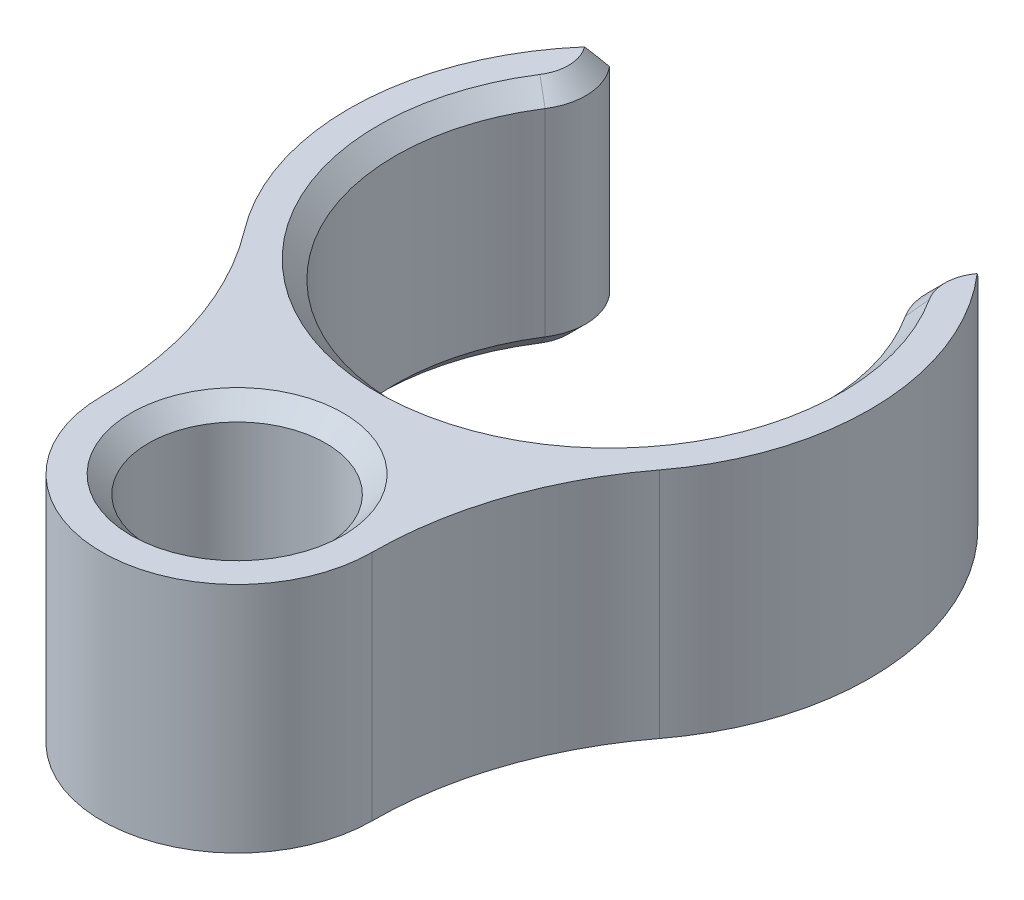
ISO-10303-21;
HEADER;
FILE_DESCRIPTION(('STEP AP214'),'2;1');
FILE_NAME('part.step','',(''),(''),'','','');
FILE_SCHEMA(('AUTOMOTIVE_DESIGN { 1 0 10303 214 1 1 1 1 }'));
ENDSEC;
DATA;
#1=APPLICATION_CONTEXT('core data for automotive mechanical design processes');
#2=APPLICATION_PROTOCOL_DEFINITION('international standard','automotive_design',2000,#1);
#3=PRODUCT_CONTEXT('',#1,'mechanical');
#4=PRODUCT('Part','Part','',(#3));
#5=PRODUCT_RELATED_PRODUCT_CATEGORY('part','',(#4));
#6=PRODUCT_DEFINITION_FORMATION('','',#4);
#7=PRODUCT_DEFINITION_CONTEXT('part definition',#1,'design');
#8=PRODUCT_DEFINITION('design','',#6,#7);
#9=PRODUCT_DEFINITION_SHAPE('','',#8);
#10=(LENGTH_UNIT() NAMED_UNIT(*) SI_UNIT(.MILLI.,.METRE.));
#11=(NAMED_UNIT(*) PLANE_ANGLE_UNIT() SI_UNIT($,.RADIAN.));
#12=(NAMED_UNIT(*) SI_UNIT($,.STERADIAN.) SOLID_ANGLE_UNIT());
#13=UNCERTAINTY_MEASURE_WITH_UNIT(LENGTH_MEASURE(1.E-05),#10,'distance_accuracy_value','');
#14=(GEOMETRIC_REPRESENTATION_CONTEXT(3) GLOBAL_UNCERTAINTY_ASSIGNED_CONTEXT((#13)) GLOBAL_UNIT_ASSIGNED_CONTEXT((#10,
#11,#12)) REPRESENTATION_CONTEXT('',''));
#15=CARTESIAN_POINT('',(0.,0.,0.));
#16=DIRECTION('',(0.,0.,1.));
#17=DIRECTION('',(1.,0.,0.));
#18=AXIS2_PLACEMENT_3D('',#15,#16,#17);
#19=CARTESIAN_POINT('',(0.,10.,-16.01));
#20=DIRECTION('',(0.,-1.,0.));
#21=DIRECTION('',(0.,0.,-1.));
#22=AXIS2_PLACEMENT_3D('',#19,#20,#21);
#23=CYLINDRICAL_SURFACE('',#22,11.2);
#24=DIRECTION('',(0.,-1.,0.));
#25=VECTOR('',#24,1.);
#26=CARTESIAN_POINT('',(-7.91959594928932,10.,-23.9295959492893));
#27=LINE('',#26,#25);
#28=CARTESIAN_POINT('',(-7.91959594928932,9.25,-23.9295959492893));
#29=VERTEX_POINT('',#28);
#30=CARTESIAN_POINT('',(-7.91959594928932,0.750000000000004,-23.9295959492893));
#31=VERTEX_POINT('',#30);
#32=EDGE_CURVE('E152',#29,#31,#27,.T.);
#33=ORIENTED_EDGE('',*,*,#32,.T.);
#34=CARTESIAN_POINT('',(-7.91959594928932,0.750000000000004,-23.9295959492893));
#35=CARTESIAN_POINT('',(-7.96415289216717,0.687261906162948,-23.8850385754403));
#36=CARTESIAN_POINT('',(-8.00835691250786,0.624555856665795,-23.8400829572508));
#37=CARTESIAN_POINT('',(-8.09606082038429,0.499253516320336,-23.7493656359172));
#38=CARTESIAN_POINT('',(-8.13956081283976,0.43665721038037,-23.7036040550467));
#39=CARTESIAN_POINT('',(-8.22587186522324,0.311601002962958,-23.6112517226287));
#40=CARTESIAN_POINT('',(-8.26868292374682,0.249141101763802,-23.5646609693913));
#41=CARTESIAN_POINT('',(-8.35364405397742,0.124410619117576,-23.4706061231883));
#42=CARTESIAN_POINT('',(-8.39579402522303,0.0621400675819424,-23.4231418998235));
#43=CARTESIAN_POINT('',(-8.43762103205099,0.,-23.3752258159197));
#44=B_SPLINE_CURVE_WITH_KNOTS('',3,(#34,#35,#36,#37,#38,#39,#40,#41,#42,#43),.UNSPECIFIED.,.F.,
.F.,(4,2,2,2,4),(0.,0.266758249137236,0.533476370854935,0.800195036220647,1.06695384797462),.UNSPECIFIED.);
#45=CARTESIAN_POINT('',(-8.43762103205099,0.,-23.3752258159197));
#46=VERTEX_POINT('',#45);
#47=EDGE_CURVE('E219',#31,#46,#44,.T.);
#48=ORIENTED_EDGE('',*,*,#47,.T.);
#49=CARTESIAN_POINT('',(0.,0.,-16.01));
#50=DIRECTION('',(0.,1.,0.));
#51=DIRECTION('',(0.,0.,1.));
#52=AXIS2_PLACEMENT_3D('',#49,#50,#51);
#53=CIRCLE('',#52,11.2);
#54=CARTESIAN_POINT('',(-8.91958501914342,0.,-9.2364482665095));
#55=VERTEX_POINT('',#54);
#56=EDGE_CURVE('E148',#46,#55,#53,.T.);
#57=ORIENTED_EDGE('',*,*,#56,.T.);
#58=DIRECTION('',(0.,-1.,0.));
#59=VECTOR('',#58,1.);
#60=CARTESIAN_POINT('',(-8.91958501914342,10.,-9.2364482665095));
#61=LINE('',#60,#59);
#62=CARTESIAN_POINT('',(-8.91958501914342,10.,-9.2364482665095));
#63=VERTEX_POINT('',#62);
#64=EDGE_CURVE('E145',#63,#55,#61,.T.);
#65=ORIENTED_EDGE('',*,*,#64,.F.);
#66=CARTESIAN_POINT('',(0.,10.,-16.01));
#67=DIRECTION('',(0.,1.,0.));
#68=DIRECTION('',(0.,0.,1.));
#69=AXIS2_PLACEMENT_3D('',#66,#67,#68);
#70=CIRCLE('',#69,11.2);
#71=CARTESIAN_POINT('',(-8.43762103205099,10.,-23.3752258159197));
#72=VERTEX_POINT('',#71);
#73=EDGE_CURVE('E134',#72,#63,#70,.T.);
#74=ORIENTED_EDGE('',*,*,#73,.F.);
#75=CARTESIAN_POINT('',(-8.43762103205099,10.,-23.3752258159197));
#76=CARTESIAN_POINT('',(-8.39579402522303,9.93785993241806,-23.4231418998235));
#77=CARTESIAN_POINT('',(-8.35364405397742,9.87558938088242,-23.4706061231883));
#78=CARTESIAN_POINT('',(-8.26868292374682,9.7508588982362,-23.5646609693913));
#79=CARTESIAN_POINT('',(-8.22587186522324,9.68839899703704,-23.6112517226287));
#80=CARTESIAN_POINT('',(-8.13956081283976,9.56334278961963,-23.7036040550467));
#81=CARTESIAN_POINT('',(-8.09606082038429,9.50074648367966,-23.7493656359172));
#82=CARTESIAN_POINT('',(-8.00835691250786,9.37544414333421,-23.8400829572508));
#83=CARTESIAN_POINT('',(-7.96415289216717,9.31273809383705,-23.8850385754403));
#84=CARTESIAN_POINT('',(-7.91959594928932,9.25,-23.9295959492893));
#85=B_SPLINE_CURVE_WITH_KNOTS('',3,(#75,#76,#77,#78,#79,#80,#81,#82,#83,#84),.UNSPECIFIED.,.F.,
.F.,(4,2,2,2,4),(0.,0.266758811753973,0.533477477119688,0.800195598837387,1.06695384797462),.UNSPECIFIED.);
#86=EDGE_CURVE('E211',#72,#29,#85,.T.);
#87=ORIENTED_EDGE('',*,*,#86,.T.);
#88=EDGE_LOOP('',(#33,#48,#57,#65,#74,#87));
#89=FACE_BOUND('',#88,.T.);
#90=ADVANCED_FACE('F43',(#89),#23,.T.);
#91=CARTESIAN_POINT('',(-21.0823747680891,10.,0.));
#92=DIRECTION('',(0.,-1.,0.));
#93=DIRECTION('',(0.,0.,-1.));
#94=AXIS2_PLACEMENT_3D('',#91,#92,#93);
#95=CYLINDRICAL_SURFACE('',#94,15.2723747680891);
#96=CARTESIAN_POINT('',(-21.0823747680891,0.,0.));
#97=DIRECTION('',(0.,1.,0.));
#98=DIRECTION('',(0.,0.,1.));
#99=AXIS2_PLACEMENT_3D('',#96,#97,#98);
#100=CIRCLE('',#99,15.2723747680891);
#101=CARTESIAN_POINT('',(-5.81,0.,0.));
#102=VERTEX_POINT('',#101);
#103=EDGE_CURVE('E164',#102,#55,#100,.T.);
#104=ORIENTED_EDGE('',*,*,#103,.F.);
#105=DIRECTION('',(0.,-1.,0.));
#106=VECTOR('',#105,1.);
#107=CARTESIAN_POINT('',(-5.81,10.,0.));
#108=LINE('',#107,#106);
#109=CARTESIAN_POINT('',(-5.81,10.,0.));
#110=VERTEX_POINT('',#109);
#111=EDGE_CURVE('E153',#110,#102,#108,.T.);
#112=ORIENTED_EDGE('',*,*,#111,.F.);
#113=CARTESIAN_POINT('',(-21.0823747680891,10.,0.));
#114=DIRECTION('',(0.,1.,0.));
#115=DIRECTION('',(0.,0.,1.));
#116=AXIS2_PLACEMENT_3D('',#113,#114,#115);
#117=CIRCLE('',#116,15.2723747680891);
#118=EDGE_CURVE('E138',#110,#63,#117,.T.);
#119=ORIENTED_EDGE('',*,*,#118,.T.);
#120=ORIENTED_EDGE('',*,*,#64,.T.);
#121=EDGE_LOOP('',(#104,#112,#119,#120));
#122=FACE_BOUND('',#121,.T.);
#123=ADVANCED_FACE('F155',(#122),#95,.F.);
#124=CARTESIAN_POINT('',(0.,10.,0.));
#125=DIRECTION('',(0.,-1.,0.));
#126=DIRECTION('',(0.,0.,-1.));
#127=AXIS2_PLACEMENT_3D('',#124,#125,#126);
#128=CYLINDRICAL_SURFACE('',#127,5.81);
#129=CARTESIAN_POINT('',(0.,0.,0.));
#130=DIRECTION('',(0.,1.,0.));
#131=DIRECTION('',(0.,0.,1.));
#132=AXIS2_PLACEMENT_3D('',#129,#130,#131);
#133=CIRCLE('',#132,5.81);
#134=CARTESIAN_POINT('',(5.81,0.,0.));
#135=VERTEX_POINT('',#134);
#136=EDGE_CURVE('E167',#102,#135,#133,.T.);
#137=ORIENTED_EDGE('',*,*,#136,.T.);
#138=DIRECTION('',(0.,-1.,0.));
#139=VECTOR('',#138,1.);
#140=CARTESIAN_POINT('',(5.81,10.,0.));
#141=LINE('',#140,#139);
#142=CARTESIAN_POINT('',(5.81,10.,0.));
#143=VERTEX_POINT('',#142);
#144=EDGE_CURVE('E177',#143,#135,#141,.T.);
#145=ORIENTED_EDGE('',*,*,#144,.F.);
#146=CARTESIAN_POINT('',(0.,10.,0.));
#147=DIRECTION('',(0.,1.,0.));
#148=DIRECTION('',(0.,0.,1.));
#149=AXIS2_PLACEMENT_3D('',#146,#147,#148);
#150=CIRCLE('',#149,5.81);
#151=EDGE_CURVE('E157',#110,#143,#150,.T.);
#152=ORIENTED_EDGE('',*,*,#151,.F.);
#153=ORIENTED_EDGE('',*,*,#111,.T.);
#154=EDGE_LOOP('',(#137,#145,#152,#153));
#155=FACE_BOUND('',#154,.T.);
#156=ADVANCED_FACE('F303',(#155),#128,.T.);
#157=CARTESIAN_POINT('',(21.0823747680891,10.,0.));
#158=DIRECTION('',(0.,-1.,0.));
#159=DIRECTION('',(0.,0.,-1.));
#160=AXIS2_PLACEMENT_3D('',#157,#158,#159);
#161=CYLINDRICAL_SURFACE('',#160,15.2723747680891);
#162=CARTESIAN_POINT('',(21.0823747680891,0.,0.));
#163=DIRECTION('',(0.,1.,0.));
#164=DIRECTION('',(0.,0.,1.));
#165=AXIS2_PLACEMENT_3D('',#162,#163,#164);
#166=CIRCLE('',#165,15.2723747680891);
#167=CARTESIAN_POINT('',(8.91958501914342,0.,-9.2364482665095));
#168=VERTEX_POINT('',#167);
#169=EDGE_CURVE('E169',#135,#168,#166,.F.);
#170=ORIENTED_EDGE('',*,*,#169,.T.);
#171=DIRECTION('',(0.,-1.,0.));
#172=VECTOR('',#171,1.);
#173=CARTESIAN_POINT('',(8.91958501914342,10.,-9.2364482665095));
#174=LINE('',#173,#172);
#175=CARTESIAN_POINT('',(8.91958501914342,10.,-9.2364482665095));
#176=VERTEX_POINT('',#175);
#177=EDGE_CURVE('E174',#176,#168,#174,.T.);
#178=ORIENTED_EDGE('',*,*,#177,.F.);
#179=CARTESIAN_POINT('',(21.0823747680891,10.,0.));
#180=DIRECTION('',(0.,1.,0.));
#181=DIRECTION('',(0.,0.,1.));
#182=AXIS2_PLACEMENT_3D('',#179,#180,#181);
#183=CIRCLE('',#182,15.2723747680891);
#184=EDGE_CURVE('E159',#143,#176,#183,.F.);
#185=ORIENTED_EDGE('',*,*,#184,.F.);
#186=ORIENTED_EDGE('',*,*,#144,.T.);
#187=EDGE_LOOP('',(#170,#178,#185,#186));
#188=FACE_BOUND('',#187,.T.);
#189=ADVANCED_FACE('F236',(#188),#161,.F.);
#190=CARTESIAN_POINT('',(8.43762103205099,0.,-23.3752258159198));
#191=VERTEX_POINT('',#190);
#192=EDGE_CURVE('E141',#168,#191,#53,.T.);
#193=ORIENTED_EDGE('',*,*,#192,.T.);
#194=CARTESIAN_POINT('',(8.43762103205099,0.,-23.3752258159198));
#195=CARTESIAN_POINT('',(8.39579402522303,0.0621400675819427,-23.4231418998235));
#196=CARTESIAN_POINT('',(8.35364405397741,0.124410619117577,-23.4706061231883));
#197=CARTESIAN_POINT('',(8.26868292374682,0.249141101763803,-23.5646609693913));
#198=CARTESIAN_POINT('',(8.22587186522324,0.311601002962958,-23.6112517226287));
#199=CARTESIAN_POINT('',(8.13956081283976,0.436657210380371,-23.7036040550467));
#200=CARTESIAN_POINT('',(8.09606082038428,0.499253516320336,-23.7493656359172));
#201=CARTESIAN_POINT('',(8.00835691250786,0.624555856665796,-23.8400829572508));
#202=CARTESIAN_POINT('',(7.96415289216717,0.687261906162949,-23.8850385754404));
#203=CARTESIAN_POINT('',(7.91959594928931,0.750000000000004,-23.9295959492894));
#204=B_SPLINE_CURVE_WITH_KNOTS('',3,(#194,#195,#196,#197,#198,#199,#200,#201,#202,#203),
.UNSPECIFIED.,.F.,.F.,(4,2,2,2,4),(0.,0.266758811753976,0.533477477119688,0.800195598837385,
1.06695384797462),.UNSPECIFIED.);
#205=CARTESIAN_POINT('',(7.91959594928932,0.750000000000004,-23.9295959492893));
#206=VERTEX_POINT('',#205);
#207=EDGE_CURVE('E249',#191,#206,#204,.T.);
#208=ORIENTED_EDGE('',*,*,#207,.T.);
#209=DIRECTION('',(0.,-1.,0.));
#210=VECTOR('',#209,1.);
#211=CARTESIAN_POINT('',(7.91959594928932,10.,-23.9295959492893));
#212=LINE('',#211,#210);
#213=CARTESIAN_POINT('',(7.91959594928932,9.25,-23.9295959492893));
#214=VERTEX_POINT('',#213);
#215=EDGE_CURVE('E171',#214,#206,#212,.T.);
#216=ORIENTED_EDGE('',*,*,#215,.F.);
#217=CARTESIAN_POINT('',(7.91959594928931,9.25,-23.9295959492894));
#218=CARTESIAN_POINT('',(7.96415289216717,9.31273809383705,-23.8850385754404));
#219=CARTESIAN_POINT('',(8.00835691250786,9.37544414333421,-23.8400829572508));
#220=CARTESIAN_POINT('',(8.09606082038428,9.50074648367967,-23.7493656359172));
#221=CARTESIAN_POINT('',(8.13956081283976,9.56334278961963,-23.7036040550467));
#222=CARTESIAN_POINT('',(8.22587186522324,9.68839899703704,-23.6112517226287));
#223=CARTESIAN_POINT('',(8.26868292374682,9.7508588982362,-23.5646609693913));
#224=CARTESIAN_POINT('',(8.35364405397742,9.87558938088242,-23.4706061231883));
#225=CARTESIAN_POINT('',(8.39579402522303,9.93785993241806,-23.4231418998235));
#226=CARTESIAN_POINT('',(8.43762103205099,10.,-23.3752258159197));
#227=B_SPLINE_CURVE_WITH_KNOTS('',3,(#217,#218,#219,#220,#221,#222,#223,#224,#225,#226),
.UNSPECIFIED.,.F.,.F.,(4,2,2,2,4),(0.,0.266758249137239,0.533476370854937,0.80019503622065,
1.06695384797462),.UNSPECIFIED.);
#228=CARTESIAN_POINT('',(8.43762103205099,10.,-23.3752258159197));
#229=VERTEX_POINT('',#228);
#230=EDGE_CURVE('E244',#214,#229,#227,.T.);
#231=ORIENTED_EDGE('',*,*,#230,.T.);
#232=EDGE_CURVE('E143',#176,#229,#70,.T.);
#233=ORIENTED_EDGE('',*,*,#232,.F.);
#234=ORIENTED_EDGE('',*,*,#177,.T.);
#235=EDGE_LOOP('',(#193,#208,#216,#231,#233,#234));
#236=FACE_BOUND('',#235,.T.);
#237=ADVANCED_FACE('F230',(#236),#23,.T.);
#238=CARTESIAN_POINT('',(0.,10.,-16.01));
#239=DIRECTION('',(0.,-1.,0.));
#240=DIRECTION('',(0.,0.,-1.));
#241=AXIS2_PLACEMENT_3D('',#238,#239,#240);
#242=CYLINDRICAL_SURFACE('',#241,9.2);
#243=DIRECTION('',(0.,-1.,0.));
#244=VECTOR('',#243,1.);
#245=CARTESIAN_POINT('',(7.74048286738709,10.,-20.982416412539));
#246=LINE('',#245,#244);
#247=CARTESIAN_POINT('',(7.74048286738709,9.25,-20.982416412539));
#248=VERTEX_POINT('',#247);
#249=CARTESIAN_POINT('',(7.74048286738709,0.750000000000004,-20.982416412539));
#250=VERTEX_POINT('',#249);
#251=EDGE_CURVE('E197',#248,#250,#246,.T.);
#252=ORIENTED_EDGE('',*,*,#251,.T.);
#253=CARTESIAN_POINT('',(0.,0.750000000000004,-16.01));
#254=DIRECTION('',(0.,1.,0.));
#255=DIRECTION('',(0.,0.,1.));
#256=AXIS2_PLACEMENT_3D('',#253,#254,#255);
#257=CIRCLE('',#256,9.2);
#258=CARTESIAN_POINT('',(-7.74048286738709,0.750000000000004,-20.982416412539));
#259=VERTEX_POINT('',#258);
#260=EDGE_CURVE('E535',#250,#259,#257,.F.);
#261=ORIENTED_EDGE('',*,*,#260,.T.);
#262=DIRECTION('',(0.,-1.,0.));
#263=VECTOR('',#262,1.);
#264=CARTESIAN_POINT('',(-7.74048286738709,10.,-20.982416412539));
#265=LINE('',#264,#263);
#266=CARTESIAN_POINT('',(-7.74048286738709,9.25,-20.982416412539));
#267=VERTEX_POINT('',#266);
#268=EDGE_CURVE('E194',#259,#267,#265,.F.);
#269=ORIENTED_EDGE('',*,*,#268,.T.);
#270=CARTESIAN_POINT('',(0.,9.25,-16.01));
#271=DIRECTION('',(0.,1.,0.));
#272=DIRECTION('',(0.,0.,1.));
#273=AXIS2_PLACEMENT_3D('',#270,#271,#272);
#274=CIRCLE('',#273,9.2);
#275=EDGE_CURVE('E537',#267,#248,#274,.T.);
#276=ORIENTED_EDGE('',*,*,#275,.T.);
#277=EDGE_LOOP('',(#252,#261,#269,#276));
#278=FACE_BOUND('',#277,.T.);
#279=ADVANCED_FACE('F235',(#278),#242,.F.);
#280=CARTESIAN_POINT('',(0.,10.,0.));
#281=DIRECTION('',(0.,-1.,0.));
#282=DIRECTION('',(0.,0.,-1.));
#283=AXIS2_PLACEMENT_3D('',#280,#281,#282);
#284=CYLINDRICAL_SURFACE('',#283,3.81);
#285=CARTESIAN_POINT('',(0.,0.749999999999999,0.));
#286=DIRECTION('',(0.,1.,0.));
#287=DIRECTION('',(0.,0.,1.));
#288=AXIS2_PLACEMENT_3D('',#285,#286,#287);
#289=CIRCLE('',#288,3.81);
#290=CARTESIAN_POINT('',(0.,0.749999999999999,3.81));
#291=VERTEX_POINT('',#290);
#292=EDGE_CURVE('E188',#291,#291,#289,.F.);
#293=ORIENTED_EDGE('',*,*,#292,.T.);
#294=EDGE_LOOP('',(#293));
#295=FACE_BOUND('',#294,.T.);
#296=CARTESIAN_POINT('',(0.,9.24999999999999,0.));
#297=DIRECTION('',(0.,1.,0.));
#298=DIRECTION('',(0.,0.,1.));
#299=AXIS2_PLACEMENT_3D('',#296,#297,#298);
#300=CIRCLE('',#299,3.81);
#301=CARTESIAN_POINT('',(0.,9.24999999999999,3.81));
#302=VERTEX_POINT('',#301);
#303=EDGE_CURVE('E185',#302,#302,#300,.T.);
#304=ORIENTED_EDGE('',*,*,#303,.T.);
#305=EDGE_LOOP('',(#304));
#306=FACE_BOUND('',#305,.T.);
#307=ADVANCED_FACE('F343',(#295,#306),#284,.F.);
#308=CARTESIAN_POINT('',(0.,10.,0.));
#309=DIRECTION('',(0.,1.,0.));
#310=DIRECTION('',(0.,0.,1.));
#311=AXIS2_PLACEMENT_3D('',#308,#309,#310);
#312=PLANE('',#311);
#313=CARTESIAN_POINT('',(0.,10.,0.));
#314=DIRECTION('',(0.,1.,0.));
#315=DIRECTION('',(0.,0.,1.));
#316=AXIS2_PLACEMENT_3D('',#313,#314,#315);
#317=CIRCLE('',#316,4.56000000000001);
#318=CARTESIAN_POINT('',(0.,10.,4.56000000000001));
#319=VERTEX_POINT('',#318);
#320=EDGE_CURVE('E191',#319,#319,#317,.F.);
#321=ORIENTED_EDGE('',*,*,#320,.T.);
#322=EDGE_LOOP('',(#321));
#323=FACE_BOUND('',#322,.T.);
#324=CARTESIAN_POINT('',(0.,10.,-16.01));
#325=DIRECTION('',(0.,1.,0.));
#326=DIRECTION('',(0.,0.,1.));
#327=AXIS2_PLACEMENT_3D('',#324,#325,#326);
#328=CIRCLE('',#327,9.95);
#329=CARTESIAN_POINT('',(8.37150049244583,10.,-21.3877764461699));
#330=VERTEX_POINT('',#329);
#331=CARTESIAN_POINT('',(-8.37150049244583,10.,-21.3877764461699));
#332=VERTEX_POINT('',#331);
#333=EDGE_CURVE('E61',#330,#332,#328,.F.);
#334=ORIENTED_EDGE('',*,*,#333,.T.);
#335=CARTESIAN_POINT('',(-9.8438749509162,10.,-22.3336165246419));
#336=DIRECTION('',(0.,1.,0.));
#337=DIRECTION('',(0.,0.,1.));
#338=AXIS2_PLACEMENT_3D('',#335,#336,#337);
#339=CIRCLE('',#338,1.75);
#340=EDGE_CURVE('E11',#332,#72,#339,.T.);
#341=ORIENTED_EDGE('',*,*,#340,.T.);
#342=ORIENTED_EDGE('',*,*,#73,.T.);
#343=ORIENTED_EDGE('',*,*,#118,.F.);
#344=ORIENTED_EDGE('',*,*,#151,.T.);
#345=ORIENTED_EDGE('',*,*,#184,.T.);
#346=ORIENTED_EDGE('',*,*,#232,.T.);
#347=CARTESIAN_POINT('',(9.84387495091619,10.,-22.3336165246419));
#348=DIRECTION('',(0.,1.,0.));
#349=DIRECTION('',(0.,0.,1.));
#350=AXIS2_PLACEMENT_3D('',#347,#348,#349);
#351=CIRCLE('',#350,1.75);
#352=EDGE_CURVE('E54',#229,#330,#351,.T.);
#353=ORIENTED_EDGE('',*,*,#352,.T.);
#354=EDGE_LOOP('',(#334,#341,#342,#343,#344,#345,#346,#353));
#355=FACE_BOUND('',#354,.T.);
#356=ADVANCED_FACE('F136',(#323,#355),#312,.T.);
#357=CARTESIAN_POINT('',(0.,0.,0.));
#358=DIRECTION('',(0.,1.,0.));
#359=DIRECTION('',(0.,0.,1.));
#360=AXIS2_PLACEMENT_3D('',#357,#358,#359);
#361=PLANE('',#360);
#362=ORIENTED_EDGE('',*,*,#56,.F.);
#363=CARTESIAN_POINT('',(-9.8438749509162,0.,-22.3336165246419));
#364=DIRECTION('',(0.,1.,0.));
#365=DIRECTION('',(0.,0.,1.));
#366=AXIS2_PLACEMENT_3D('',#363,#364,#365);
#367=CIRCLE('',#366,1.75);
#368=CARTESIAN_POINT('',(-8.37150049244583,0.,-21.3877764461699));
#369=VERTEX_POINT('',#368);
#370=EDGE_CURVE('E204',#46,#369,#367,.F.);
#371=ORIENTED_EDGE('',*,*,#370,.T.);
#372=CARTESIAN_POINT('',(0.,0.,-16.01));
#373=DIRECTION('',(0.,1.,0.));
#374=DIRECTION('',(0.,0.,1.));
#375=AXIS2_PLACEMENT_3D('',#372,#373,#374);
#376=CIRCLE('',#375,9.95);
#377=CARTESIAN_POINT('',(8.37150049244583,0.,-21.3877764461699));
#378=VERTEX_POINT('',#377);
#379=EDGE_CURVE('E200',#369,#378,#376,.T.);
#380=ORIENTED_EDGE('',*,*,#379,.T.);
#381=CARTESIAN_POINT('',(9.84387495091619,0.,-22.3336165246419));
#382=DIRECTION('',(0.,1.,0.));
#383=DIRECTION('',(0.,0.,1.));
#384=AXIS2_PLACEMENT_3D('',#381,#382,#383);
#385=CIRCLE('',#384,1.75);
#386=EDGE_CURVE('E202',#378,#191,#385,.F.);
#387=ORIENTED_EDGE('',*,*,#386,.T.);
#388=ORIENTED_EDGE('',*,*,#192,.F.);
#389=ORIENTED_EDGE('',*,*,#169,.F.);
#390=ORIENTED_EDGE('',*,*,#136,.F.);
#391=ORIENTED_EDGE('',*,*,#103,.T.);
#392=EDGE_LOOP('',(#362,#371,#380,#387,#388,#389,#390,#391));
#393=FACE_BOUND('',#392,.T.);
#394=CARTESIAN_POINT('',(0.,0.,0.));
#395=DIRECTION('',(0.,1.,0.));
#396=DIRECTION('',(0.,0.,1.));
#397=AXIS2_PLACEMENT_3D('',#394,#395,#396);
#398=CIRCLE('',#397,4.55999999999999);
#399=CARTESIAN_POINT('',(0.,0.,4.55999999999999));
#400=VERTEX_POINT('',#399);
#401=EDGE_CURVE('E182',#400,#400,#398,.T.);
#402=ORIENTED_EDGE('',*,*,#401,.T.);
#403=EDGE_LOOP('',(#402));
#404=FACE_BOUND('',#403,.T.);
#405=ADVANCED_FACE('F300',(#393,#404),#361,.F.);
#406=CARTESIAN_POINT('',(0.,0.,0.));
#407=DIRECTION('',(0.,-1.,0.));
#408=DIRECTION('',(0.,0.,-1.));
#409=AXIS2_PLACEMENT_3D('',#406,#407,#408);
#410=CONICAL_SURFACE('',#409,4.55999999999999,0.785398163397446);
#411=ORIENTED_EDGE('',*,*,#292,.F.);
#412=EDGE_LOOP('',(#411));
#413=FACE_BOUND('',#412,.T.);
#414=ORIENTED_EDGE('',*,*,#401,.F.);
#415=EDGE_LOOP('',(#414));
#416=FACE_BOUND('',#415,.T.);
#417=ADVANCED_FACE('F294',(#413,#416),#410,.F.);
#418=CARTESIAN_POINT('',(0.,9.24999999999999,0.));
#419=DIRECTION('',(0.,1.,0.));
#420=DIRECTION('',(0.,0.,1.));
#421=AXIS2_PLACEMENT_3D('',#418,#419,#420);
#422=CONICAL_SURFACE('',#421,3.81,0.785398163397447);
#423=ORIENTED_EDGE('',*,*,#320,.F.);
#424=EDGE_LOOP('',(#423));
#425=FACE_BOUND('',#424,.T.);
#426=ORIENTED_EDGE('',*,*,#303,.F.);
#427=EDGE_LOOP('',(#426));
#428=FACE_BOUND('',#427,.T.);
#429=ADVANCED_FACE('F287',(#425,#428),#422,.F.);
#430=CARTESIAN_POINT('',(9.84387495091619,10.,-22.3336165246419));
#431=DIRECTION('',(0.,-1.,0.));
#432=DIRECTION('',(0.,0.,-1.));
#433=AXIS2_PLACEMENT_3D('',#430,#431,#432);
#434=CYLINDRICAL_SURFACE('',#433,2.5);
#435=ORIENTED_EDGE('',*,*,#215,.T.);
#436=CARTESIAN_POINT('',(9.84387495091619,0.750000000000004,-22.3336165246419));
#437=DIRECTION('',(0.,1.,0.));
#438=DIRECTION('',(0.,0.,1.));
#439=AXIS2_PLACEMENT_3D('',#436,#437,#438);
#440=CIRCLE('',#439,2.5);
#441=EDGE_CURVE('E538',#206,#250,#440,.T.);
#442=ORIENTED_EDGE('',*,*,#441,.T.);
#443=ORIENTED_EDGE('',*,*,#251,.F.);
#444=CARTESIAN_POINT('',(9.84387495091619,9.25,-22.3336165246419));
#445=DIRECTION('',(0.,1.,0.));
#446=DIRECTION('',(0.,0.,1.));
#447=AXIS2_PLACEMENT_3D('',#444,#445,#446);
#448=CIRCLE('',#447,2.5);
#449=EDGE_CURVE('E255',#248,#214,#448,.F.);
#450=ORIENTED_EDGE('',*,*,#449,.T.);
#451=EDGE_LOOP('',(#435,#442,#443,#450));
#452=FACE_BOUND('',#451,.T.);
#453=ADVANCED_FACE('F283',(#452),#434,.T.);
#454=CARTESIAN_POINT('',(-9.8438749509162,10.,-22.3336165246419));
#455=DIRECTION('',(0.,-1.,0.));
#456=DIRECTION('',(0.,0.,-1.));
#457=AXIS2_PLACEMENT_3D('',#454,#455,#456);
#458=CYLINDRICAL_SURFACE('',#457,2.5);
#459=ORIENTED_EDGE('',*,*,#268,.F.);
#460=CARTESIAN_POINT('',(-9.8438749509162,0.750000000000004,-22.3336165246419));
#461=DIRECTION('',(0.,1.,0.));
#462=DIRECTION('',(0.,0.,1.));
#463=AXIS2_PLACEMENT_3D('',#460,#461,#462);
#464=CIRCLE('',#463,2.5);
#465=EDGE_CURVE('E209',#259,#31,#464,.T.);
#466=ORIENTED_EDGE('',*,*,#465,.T.);
#467=ORIENTED_EDGE('',*,*,#32,.F.);
#468=CARTESIAN_POINT('',(-9.8438749509162,9.25,-22.3336165246419));
#469=DIRECTION('',(0.,1.,0.));
#470=DIRECTION('',(0.,0.,1.));
#471=AXIS2_PLACEMENT_3D('',#468,#469,#470);
#472=CIRCLE('',#471,2.5);
#473=EDGE_CURVE('E207',#29,#267,#472,.F.);
#474=ORIENTED_EDGE('',*,*,#473,.T.);
#475=EDGE_LOOP('',(#459,#466,#467,#474));
#476=FACE_BOUND('',#475,.T.);
#477=ADVANCED_FACE('F267',(#476),#458,.T.);
#478=CARTESIAN_POINT('',(9.84387495091619,0.,-22.3336165246419));
#479=DIRECTION('',(0.,1.,0.));
#480=DIRECTION('',(0.,0.,1.));
#481=AXIS2_PLACEMENT_3D('',#478,#479,#480);
#482=CONICAL_SURFACE('',#481,1.75,0.785398163397446);
#483=ORIENTED_EDGE('',*,*,#207,.F.);
#484=ORIENTED_EDGE('',*,*,#386,.F.);
#485=DIRECTION('',(0.594929122303011,-0.707106781186549,-0.382177104803215));
#486=VECTOR('',#485,1.);
#487=CARTESIAN_POINT('',(7.74048286738709,0.750000000000004,-20.982416412539));
#488=LINE('',#487,#486);
#489=EDGE_CURVE('E165',#250,#378,#488,.T.);
#490=ORIENTED_EDGE('',*,*,#489,.F.);
#491=ORIENTED_EDGE('',*,*,#441,.F.);
#492=EDGE_LOOP('',(#483,#484,#490,#491));
#493=FACE_BOUND('',#492,.T.);
#494=ADVANCED_FACE('F258',(#493),#482,.T.);
#495=CARTESIAN_POINT('',(0.,0.,-16.01));
#496=DIRECTION('',(0.,-1.,0.));
#497=DIRECTION('',(0.,0.,-1.));
#498=AXIS2_PLACEMENT_3D('',#495,#496,#497);
#499=CONICAL_SURFACE('',#498,9.95,0.785398163397446);
#500=ORIENTED_EDGE('',*,*,#489,.T.);
#501=ORIENTED_EDGE('',*,*,#379,.F.);
#502=DIRECTION('',(-0.594929122303011,-0.707106781186549,-0.382177104803215));
#503=VECTOR('',#502,1.);
#504=CARTESIAN_POINT('',(-7.74048286738709,0.750000000000004,-20.982416412539));
#505=LINE('',#504,#503);
#506=EDGE_CURVE('E528',#259,#369,#505,.T.);
#507=ORIENTED_EDGE('',*,*,#506,.F.);
#508=ORIENTED_EDGE('',*,*,#260,.F.);
#509=EDGE_LOOP('',(#500,#501,#507,#508));
#510=FACE_BOUND('',#509,.T.);
#511=ADVANCED_FACE('F266',(#510),#499,.F.);
#512=CARTESIAN_POINT('',(-9.8438749509162,0.,-22.3336165246419));
#513=DIRECTION('',(0.,1.,0.));
#514=DIRECTION('',(0.,0.,1.));
#515=AXIS2_PLACEMENT_3D('',#512,#513,#514);
#516=CONICAL_SURFACE('',#515,1.75,0.785398163397446);
#517=ORIENTED_EDGE('',*,*,#47,.F.);
#518=ORIENTED_EDGE('',*,*,#465,.F.);
#519=ORIENTED_EDGE('',*,*,#506,.T.);
#520=ORIENTED_EDGE('',*,*,#370,.F.);
#521=EDGE_LOOP('',(#517,#518,#519,#520));
#522=FACE_BOUND('',#521,.T.);
#523=ADVANCED_FACE('F273',(#522),#516,.T.);
#524=CARTESIAN_POINT('',(9.84387495091619,10.,-22.3336165246419));
#525=DIRECTION('',(0.,-1.,0.));
#526=DIRECTION('',(0.,0.,-1.));
#527=AXIS2_PLACEMENT_3D('',#524,#525,#526);
#528=CONICAL_SURFACE('',#527,1.75,0.785398163397448);
#529=ORIENTED_EDGE('',*,*,#230,.F.);
#530=ORIENTED_EDGE('',*,*,#449,.F.);
#531=DIRECTION('',(-0.594929122303011,-0.707106781186548,0.382177104803217));
#532=VECTOR('',#531,1.);
#533=CARTESIAN_POINT('',(8.37150049244583,10.,-21.3877764461699));
#534=LINE('',#533,#532);
#535=EDGE_CURVE('E49',#330,#248,#534,.T.);
#536=ORIENTED_EDGE('',*,*,#535,.F.);
#537=ORIENTED_EDGE('',*,*,#352,.F.);
#538=EDGE_LOOP('',(#529,#530,#536,#537));
#539=FACE_BOUND('',#538,.T.);
#540=ADVANCED_FACE('F46',(#539),#528,.T.);
#541=CARTESIAN_POINT('',(0.,9.25,-16.01));
#542=DIRECTION('',(0.,1.,0.));
#543=DIRECTION('',(0.,0.,1.));
#544=AXIS2_PLACEMENT_3D('',#541,#542,#543);
#545=CONICAL_SURFACE('',#544,9.2,0.785398163397448);
#546=ORIENTED_EDGE('',*,*,#535,.T.);
#547=ORIENTED_EDGE('',*,*,#275,.F.);
#548=DIRECTION('',(0.594929122303012,-0.707106781186547,0.382177104803217));
#549=VECTOR('',#548,1.);
#550=CARTESIAN_POINT('',(-8.37150049244583,10.,-21.3877764461699));
#551=LINE('',#550,#549);
#552=EDGE_CURVE('E525',#332,#267,#551,.T.);
#553=ORIENTED_EDGE('',*,*,#552,.F.);
#554=ORIENTED_EDGE('',*,*,#333,.F.);
#555=EDGE_LOOP('',(#546,#547,#553,#554));
#556=FACE_BOUND('',#555,.T.);
#557=ADVANCED_FACE('F419',(#556),#545,.F.);
#558=CARTESIAN_POINT('',(-9.8438749509162,10.,-22.3336165246419));
#559=DIRECTION('',(0.,-1.,0.));
#560=DIRECTION('',(0.,0.,-1.));
#561=AXIS2_PLACEMENT_3D('',#558,#559,#560);
#562=CONICAL_SURFACE('',#561,1.75,0.785398163397447);
#563=ORIENTED_EDGE('',*,*,#552,.T.);
#564=ORIENTED_EDGE('',*,*,#473,.F.);
#565=ORIENTED_EDGE('',*,*,#86,.F.);
#566=ORIENTED_EDGE('',*,*,#340,.F.);
#567=EDGE_LOOP('',(#563,#564,#565,#566));
#568=FACE_BOUND('',#567,.T.);
#569=ADVANCED_FACE('F227',(#568),#562,.T.);
#570=CLOSED_SHELL('',(#90,#123,#156,#189,#237,#279,#307,#356,#405,#417,#429,#453,#477,#494,#511,
#523,#540,#557,#569));
#571=MANIFOLD_SOLID_BREP('B2',#570);
#572=ADVANCED_BREP_SHAPE_REPRESENTATION('',(#18,#571),#14);
#573=SHAPE_DEFINITION_REPRESENTATION(#9,#572);
ENDSEC;
END-ISO-10303-21;
